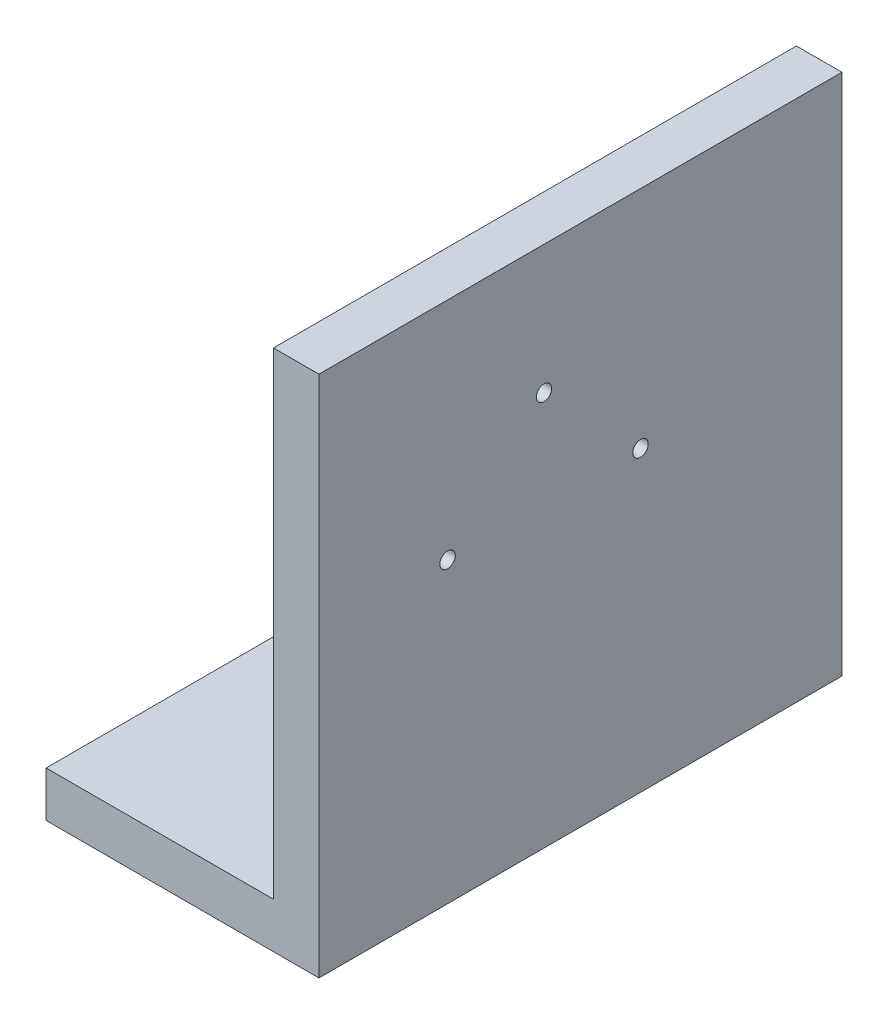
ISO-10303-21;
HEADER;
FILE_DESCRIPTION(('STEP AP214'),'2;1');
FILE_NAME('part.step','',(''),(''),'','','');
FILE_SCHEMA(('AUTOMOTIVE_DESIGN { 1 0 10303 214 1 1 1 1 }'));
ENDSEC;
DATA;
#1=APPLICATION_CONTEXT('core data for automotive mechanical design processes');
#2=APPLICATION_PROTOCOL_DEFINITION('international standard','automotive_design',2000,#1);
#3=PRODUCT_CONTEXT('',#1,'mechanical');
#4=PRODUCT('Part','Part','',(#3));
#5=PRODUCT_RELATED_PRODUCT_CATEGORY('part','',(#4));
#6=PRODUCT_DEFINITION_FORMATION('','',#4);
#7=PRODUCT_DEFINITION_CONTEXT('part definition',#1,'design');
#8=PRODUCT_DEFINITION('design','',#6,#7);
#9=PRODUCT_DEFINITION_SHAPE('','',#8);
#10=(LENGTH_UNIT() NAMED_UNIT(*) SI_UNIT(.MILLI.,.METRE.));
#11=(NAMED_UNIT(*) PLANE_ANGLE_UNIT() SI_UNIT($,.RADIAN.));
#12=(NAMED_UNIT(*) SI_UNIT($,.STERADIAN.) SOLID_ANGLE_UNIT());
#13=UNCERTAINTY_MEASURE_WITH_UNIT(LENGTH_MEASURE(1.E-05),#10,'distance_accuracy_value','');
#14=(GEOMETRIC_REPRESENTATION_CONTEXT(3) GLOBAL_UNCERTAINTY_ASSIGNED_CONTEXT((#13)) GLOBAL_UNIT_ASSIGNED_CONTEXT((#10,
#11,#12)) REPRESENTATION_CONTEXT('',''));
#15=CARTESIAN_POINT('',(0.,0.,0.));
#16=DIRECTION('',(0.,0.,1.));
#17=DIRECTION('',(1.,0.,0.));
#18=AXIS2_PLACEMENT_3D('',#15,#16,#17);
#19=CARTESIAN_POINT('',(-23565.4736245995,0.,0.));
#20=DIRECTION('',(1.,0.,0.));
#21=DIRECTION('',(0.,0.,-1.));
#22=AXIS2_PLACEMENT_3D('',#19,#20,#21);
#23=PLANE('',#22);
#24=CARTESIAN_POINT('',(-23565.4736245995,5877.69525550817,40145.5149033635));
#25=DIRECTION('',(-1.,0.,0.));
#26=DIRECTION('',(0.,0.,1.));
#27=AXIS2_PLACEMENT_3D('',#24,#25,#26);
#28=CIRCLE('',#27,3.39999999999935);
#29=CARTESIAN_POINT('',(-23565.4736245995,5877.69525550817,40148.9149033635));
#30=VERTEX_POINT('',#29);
#31=EDGE_CURVE('E139',#30,#30,#28,.T.);
#32=ORIENTED_EDGE('',*,*,#31,.F.);
#33=EDGE_LOOP('',(#32));
#34=FACE_BOUND('',#33,.T.);
#35=CARTESIAN_POINT('',(-23565.4736245995,5877.69525550817,40230.3677171059));
#36=DIRECTION('',(-1.,0.,0.));
#37=DIRECTION('',(0.,0.,1.));
#38=AXIS2_PLACEMENT_3D('',#35,#36,#37);
#39=CIRCLE('',#38,3.39999999999204);
#40=CARTESIAN_POINT('',(-23565.4736245995,5877.69525550817,40233.7677171059));
#41=VERTEX_POINT('',#40);
#42=EDGE_CURVE('E146',#41,#41,#39,.T.);
#43=ORIENTED_EDGE('',*,*,#42,.F.);
#44=EDGE_LOOP('',(#43));
#45=FACE_BOUND('',#44,.T.);
#46=CARTESIAN_POINT('',(-23565.4736245995,5920.12166237936,40187.9413102347));
#47=DIRECTION('',(-1.,0.,0.));
#48=DIRECTION('',(0.,0.,1.));
#49=AXIS2_PLACEMENT_3D('',#46,#47,#48);
#50=CIRCLE('',#49,3.39999999999935);
#51=CARTESIAN_POINT('',(-23565.4736245995,5920.12166237936,40191.3413102347));
#52=VERTEX_POINT('',#51);
#53=EDGE_CURVE('E111',#52,#52,#50,.T.);
#54=ORIENTED_EDGE('',*,*,#53,.F.);
#55=EDGE_LOOP('',(#54));
#56=FACE_BOUND('',#55,.T.);
#57=DIRECTION('',(0.,0.,-1.));
#58=VECTOR('',#57,1.);
#59=CARTESIAN_POINT('',(-23565.4736245995,5766.69020487429,40056.9362596009));
#60=LINE('',#59,#58);
#61=CARTESIAN_POINT('',(-23565.4736245995,5766.69020487429,40286.9362596009));
#62=VERTEX_POINT('',#61);
#63=CARTESIAN_POINT('',(-23565.4736245995,5766.69020487429,40056.9362596009));
#64=VERTEX_POINT('',#63);
#65=EDGE_CURVE('E54',#62,#64,#60,.T.);
#66=ORIENTED_EDGE('',*,*,#65,.F.);
#67=DIRECTION('',(0.,1.,0.));
#68=VECTOR('',#67,1.);
#69=CARTESIAN_POINT('',(-23565.4736245995,5976.69020487429,40286.9362596009));
#70=LINE('',#69,#68);
#71=CARTESIAN_POINT('',(-23565.4736245995,5976.69020487429,40286.9362596009));
#72=VERTEX_POINT('',#71);
#73=EDGE_CURVE('E92',#62,#72,#70,.T.);
#74=ORIENTED_EDGE('',*,*,#73,.T.);
#75=DIRECTION('',(0.,0.,-1.));
#76=VECTOR('',#75,1.);
#77=CARTESIAN_POINT('',(-23565.4736245995,5976.69020487429,40286.9362596009));
#78=LINE('',#77,#76);
#79=CARTESIAN_POINT('',(-23565.4736245995,5976.69020487429,40056.9362596009));
#80=VERTEX_POINT('',#79);
#81=EDGE_CURVE('E60',#72,#80,#78,.T.);
#82=ORIENTED_EDGE('',*,*,#81,.T.);
#83=DIRECTION('',(0.,-1.,0.));
#84=VECTOR('',#83,1.);
#85=CARTESIAN_POINT('',(-23565.4736245995,5976.69020487429,40056.9362596009));
#86=LINE('',#85,#84);
#87=EDGE_CURVE('E103',#80,#64,#86,.T.);
#88=ORIENTED_EDGE('',*,*,#87,.T.);
#89=EDGE_LOOP('',(#66,#74,#82,#88));
#90=FACE_BOUND('',#89,.T.);
#91=ADVANCED_FACE('F39',(#34,#45,#56,#90),#23,.F.);
#92=CARTESIAN_POINT('',(-23565.4736245995,5976.69020487429,40286.9362596009));
#93=DIRECTION('',(0.,0.,-1.));
#94=DIRECTION('',(-1.,0.,0.));
#95=AXIS2_PLACEMENT_3D('',#92,#93,#94);
#96=PLANE('',#95);
#97=DIRECTION('',(0.,1.,0.));
#98=VECTOR('',#97,1.);
#99=CARTESIAN_POINT('',(-23545.4736245995,5976.69020487429,40286.9362596009));
#100=LINE('',#99,#98);
#101=CARTESIAN_POINT('',(-23545.4736245995,5746.69020487429,40286.9362596009));
#102=VERTEX_POINT('',#101);
#103=CARTESIAN_POINT('',(-23545.4736245995,5976.69020487429,40286.9362596009));
#104=VERTEX_POINT('',#103);
#105=EDGE_CURVE('E99',#102,#104,#100,.T.);
#106=ORIENTED_EDGE('',*,*,#105,.T.);
#107=DIRECTION('',(1.,0.,0.));
#108=VECTOR('',#107,1.);
#109=CARTESIAN_POINT('',(-23565.4736245995,5976.69020487429,40286.9362596009));
#110=LINE('',#109,#108);
#111=EDGE_CURVE('E11',#72,#104,#110,.T.);
#112=ORIENTED_EDGE('',*,*,#111,.F.);
#113=ORIENTED_EDGE('',*,*,#73,.F.);
#114=DIRECTION('',(1.,0.,0.));
#115=VECTOR('',#114,1.);
#116=CARTESIAN_POINT('',(-23665.4736245995,5766.69020487429,40286.9362596009));
#117=LINE('',#116,#115);
#118=CARTESIAN_POINT('',(-23665.4736245995,5766.69020487429,40286.9362596009));
#119=VERTEX_POINT('',#118);
#120=EDGE_CURVE('E126',#119,#62,#117,.T.);
#121=ORIENTED_EDGE('',*,*,#120,.F.);
#122=DIRECTION('',(0.,1.,0.));
#123=VECTOR('',#122,1.);
#124=CARTESIAN_POINT('',(-23665.4736245995,5766.69020487429,40286.9362596009));
#125=LINE('',#124,#123);
#126=CARTESIAN_POINT('',(-23665.4736245995,5746.69020487429,40286.9362596009));
#127=VERTEX_POINT('',#126);
#128=EDGE_CURVE('E102',#127,#119,#125,.T.);
#129=ORIENTED_EDGE('',*,*,#128,.F.);
#130=DIRECTION('',(1.,0.,0.));
#131=VECTOR('',#130,1.);
#132=CARTESIAN_POINT('',(-23565.4736245995,5746.69020487429,40286.9362596009));
#133=LINE('',#132,#131);
#134=EDGE_CURVE('E85',#127,#102,#133,.T.);
#135=ORIENTED_EDGE('',*,*,#134,.T.);
#136=EDGE_LOOP('',(#106,#112,#113,#121,#129,#135));
#137=FACE_BOUND('',#136,.T.);
#138=ADVANCED_FACE('F41',(#137),#96,.F.);
#139=CARTESIAN_POINT('',(-23565.4736245995,5976.69020487429,40286.9362596009));
#140=DIRECTION('',(0.,-1.,0.));
#141=DIRECTION('',(1.,0.,0.));
#142=AXIS2_PLACEMENT_3D('',#139,#140,#141);
#143=PLANE('',#142);
#144=DIRECTION('',(0.,0.,-1.));
#145=VECTOR('',#144,1.);
#146=CARTESIAN_POINT('',(-23545.4736245995,5976.69020487429,40286.9362596009));
#147=LINE('',#146,#145);
#148=CARTESIAN_POINT('',(-23545.4736245995,5976.69020487429,40056.9362596009));
#149=VERTEX_POINT('',#148);
#150=EDGE_CURVE('E106',#104,#149,#147,.T.);
#151=ORIENTED_EDGE('',*,*,#150,.T.);
#152=DIRECTION('',(1.,0.,0.));
#153=VECTOR('',#152,1.);
#154=CARTESIAN_POINT('',(-23565.4736245995,5976.69020487429,40056.9362596009));
#155=LINE('',#154,#153);
#156=EDGE_CURVE('E47',#80,#149,#155,.T.);
#157=ORIENTED_EDGE('',*,*,#156,.F.);
#158=ORIENTED_EDGE('',*,*,#81,.F.);
#159=ORIENTED_EDGE('',*,*,#111,.T.);
#160=EDGE_LOOP('',(#151,#157,#158,#159));
#161=FACE_BOUND('',#160,.T.);
#162=ADVANCED_FACE('F123',(#161),#143,.F.);
#163=CARTESIAN_POINT('',(-23565.4736245995,5976.69020487429,40056.9362596009));
#164=DIRECTION('',(0.,0.,1.));
#165=DIRECTION('',(1.,0.,0.));
#166=AXIS2_PLACEMENT_3D('',#163,#164,#165);
#167=PLANE('',#166);
#168=DIRECTION('',(0.,-1.,0.));
#169=VECTOR('',#168,1.);
#170=CARTESIAN_POINT('',(-23545.4736245995,5976.69020487429,40056.9362596009));
#171=LINE('',#170,#169);
#172=CARTESIAN_POINT('',(-23545.4736245995,5746.69020487429,40056.9362596009));
#173=VERTEX_POINT('',#172);
#174=EDGE_CURVE('E93',#149,#173,#171,.T.);
#175=ORIENTED_EDGE('',*,*,#174,.T.);
#176=DIRECTION('',(1.,0.,0.));
#177=VECTOR('',#176,1.);
#178=CARTESIAN_POINT('',(-23565.4736245995,5746.69020487429,40056.9362596009));
#179=LINE('',#178,#177);
#180=CARTESIAN_POINT('',(-23665.4736245995,5746.69020487429,40056.9362596009));
#181=VERTEX_POINT('',#180);
#182=EDGE_CURVE('E88',#181,#173,#179,.T.);
#183=ORIENTED_EDGE('',*,*,#182,.F.);
#184=DIRECTION('',(0.,-1.,0.));
#185=VECTOR('',#184,1.);
#186=CARTESIAN_POINT('',(-23665.4736245995,5766.69020487429,40056.9362596009));
#187=LINE('',#186,#185);
#188=CARTESIAN_POINT('',(-23665.4736245995,5766.69020487429,40056.9362596009));
#189=VERTEX_POINT('',#188);
#190=EDGE_CURVE('E164',#189,#181,#187,.T.);
#191=ORIENTED_EDGE('',*,*,#190,.F.);
#192=DIRECTION('',(1.,0.,0.));
#193=VECTOR('',#192,1.);
#194=CARTESIAN_POINT('',(-23665.4736245995,5766.69020487429,40056.9362596009));
#195=LINE('',#194,#193);
#196=EDGE_CURVE('E136',#189,#64,#195,.T.);
#197=ORIENTED_EDGE('',*,*,#196,.T.);
#198=ORIENTED_EDGE('',*,*,#87,.F.);
#199=ORIENTED_EDGE('',*,*,#156,.T.);
#200=EDGE_LOOP('',(#175,#183,#191,#197,#198,#199));
#201=FACE_BOUND('',#200,.T.);
#202=ADVANCED_FACE('F120',(#201),#167,.F.);
#203=CARTESIAN_POINT('',(-23565.4736245995,5746.69020487429,40286.9362596009));
#204=DIRECTION('',(0.,1.,0.));
#205=DIRECTION('',(-1.,0.,0.));
#206=AXIS2_PLACEMENT_3D('',#203,#204,#205);
#207=PLANE('',#206);
#208=DIRECTION('',(0.,0.,1.));
#209=VECTOR('',#208,1.);
#210=CARTESIAN_POINT('',(-23545.4736245995,5746.69020487429,40286.9362596009));
#211=LINE('',#210,#209);
#212=EDGE_CURVE('E80',#173,#102,#211,.T.);
#213=ORIENTED_EDGE('',*,*,#212,.T.);
#214=ORIENTED_EDGE('',*,*,#134,.F.);
#215=DIRECTION('',(0.,0.,1.));
#216=VECTOR('',#215,1.);
#217=CARTESIAN_POINT('',(-23665.4736245995,5746.69020487429,40056.9362596009));
#218=LINE('',#217,#216);
#219=EDGE_CURVE('E161',#181,#127,#218,.T.);
#220=ORIENTED_EDGE('',*,*,#219,.F.);
#221=ORIENTED_EDGE('',*,*,#182,.T.);
#222=EDGE_LOOP('',(#213,#214,#220,#221));
#223=FACE_BOUND('',#222,.T.);
#224=ADVANCED_FACE('F82',(#223),#207,.F.);
#225=CARTESIAN_POINT('',(-23545.4736245995,0.,0.));
#226=DIRECTION('',(1.,0.,0.));
#227=DIRECTION('',(0.,0.,-1.));
#228=AXIS2_PLACEMENT_3D('',#225,#226,#227);
#229=PLANE('',#228);
#230=CARTESIAN_POINT('',(-23545.4736245995,5920.12166237936,40187.9413102347));
#231=DIRECTION('',(-1.,0.,0.));
#232=DIRECTION('',(0.,0.,1.));
#233=AXIS2_PLACEMENT_3D('',#230,#231,#232);
#234=CIRCLE('',#233,3.39999999999935);
#235=CARTESIAN_POINT('',(-23545.4736245995,5920.12166237936,40191.3413102347));
#236=VERTEX_POINT('',#235);
#237=EDGE_CURVE('E107',#236,#236,#234,.T.);
#238=ORIENTED_EDGE('',*,*,#237,.T.);
#239=EDGE_LOOP('',(#238));
#240=FACE_BOUND('',#239,.T.);
#241=CARTESIAN_POINT('',(-23545.4736245995,5877.69525550817,40230.3677171059));
#242=DIRECTION('',(-1.,0.,0.));
#243=DIRECTION('',(0.,0.,1.));
#244=AXIS2_PLACEMENT_3D('',#241,#242,#243);
#245=CIRCLE('',#244,3.39999999999204);
#246=CARTESIAN_POINT('',(-23545.4736245995,5877.69525550817,40233.7677171059));
#247=VERTEX_POINT('',#246);
#248=EDGE_CURVE('E149',#247,#247,#245,.T.);
#249=ORIENTED_EDGE('',*,*,#248,.T.);
#250=EDGE_LOOP('',(#249));
#251=FACE_BOUND('',#250,.T.);
#252=CARTESIAN_POINT('',(-23545.4736245995,5877.69525550817,40145.5149033635));
#253=DIRECTION('',(-1.,0.,0.));
#254=DIRECTION('',(0.,0.,1.));
#255=AXIS2_PLACEMENT_3D('',#252,#253,#254);
#256=CIRCLE('',#255,3.39999999999935);
#257=CARTESIAN_POINT('',(-23545.4736245995,5877.69525550817,40148.9149033635));
#258=VERTEX_POINT('',#257);
#259=EDGE_CURVE('E135',#258,#258,#256,.T.);
#260=ORIENTED_EDGE('',*,*,#259,.T.);
#261=EDGE_LOOP('',(#260));
#262=FACE_BOUND('',#261,.T.);
#263=ORIENTED_EDGE('',*,*,#105,.F.);
#264=ORIENTED_EDGE('',*,*,#212,.F.);
#265=ORIENTED_EDGE('',*,*,#174,.F.);
#266=ORIENTED_EDGE('',*,*,#150,.F.);
#267=EDGE_LOOP('',(#263,#264,#265,#266));
#268=FACE_BOUND('',#267,.T.);
#269=ADVANCED_FACE('F105',(#240,#251,#262,#268),#229,.T.);
#270=CARTESIAN_POINT('',(-23545.4736245995,5877.69525550817,40145.5149033635));
#271=DIRECTION('',(-1.,0.,0.));
#272=DIRECTION('',(0.,0.,1.));
#273=AXIS2_PLACEMENT_3D('',#270,#271,#272);
#274=CYLINDRICAL_SURFACE('',#273,3.39999999999935);
#275=ORIENTED_EDGE('',*,*,#259,.F.);
#276=EDGE_LOOP('',(#275));
#277=FACE_BOUND('',#276,.T.);
#278=ORIENTED_EDGE('',*,*,#31,.T.);
#279=EDGE_LOOP('',(#278));
#280=FACE_BOUND('',#279,.T.);
#281=ADVANCED_FACE('F185',(#277,#280),#274,.F.);
#282=CARTESIAN_POINT('',(-23545.4736245995,5877.69525550817,40230.3677171059));
#283=DIRECTION('',(-1.,0.,0.));
#284=DIRECTION('',(0.,0.,1.));
#285=AXIS2_PLACEMENT_3D('',#282,#283,#284);
#286=CYLINDRICAL_SURFACE('',#285,3.39999999999204);
#287=ORIENTED_EDGE('',*,*,#248,.F.);
#288=EDGE_LOOP('',(#287));
#289=FACE_BOUND('',#288,.T.);
#290=ORIENTED_EDGE('',*,*,#42,.T.);
#291=EDGE_LOOP('',(#290));
#292=FACE_BOUND('',#291,.T.);
#293=ADVANCED_FACE('F217',(#289,#292),#286,.F.);
#294=CARTESIAN_POINT('',(-23545.4736245995,5920.12166237936,40187.9413102347));
#295=DIRECTION('',(-1.,0.,0.));
#296=DIRECTION('',(0.,0.,1.));
#297=AXIS2_PLACEMENT_3D('',#294,#295,#296);
#298=CYLINDRICAL_SURFACE('',#297,3.39999999999935);
#299=ORIENTED_EDGE('',*,*,#237,.F.);
#300=EDGE_LOOP('',(#299));
#301=FACE_BOUND('',#300,.T.);
#302=ORIENTED_EDGE('',*,*,#53,.T.);
#303=EDGE_LOOP('',(#302));
#304=FACE_BOUND('',#303,.T.);
#305=ADVANCED_FACE('F173',(#301,#304),#298,.F.);
#306=CARTESIAN_POINT('',(-23665.4736245995,5766.69020487429,40056.9362596009));
#307=DIRECTION('',(0.,-1.,0.));
#308=DIRECTION('',(0.,0.,-1.));
#309=AXIS2_PLACEMENT_3D('',#306,#307,#308);
#310=PLANE('',#309);
#311=ORIENTED_EDGE('',*,*,#65,.T.);
#312=ORIENTED_EDGE('',*,*,#196,.F.);
#313=DIRECTION('',(0.,0.,-1.));
#314=VECTOR('',#313,1.);
#315=CARTESIAN_POINT('',(-23665.4736245995,5766.69020487429,40056.9362596009));
#316=LINE('',#315,#314);
#317=EDGE_CURVE('E134',#119,#189,#316,.T.);
#318=ORIENTED_EDGE('',*,*,#317,.F.);
#319=ORIENTED_EDGE('',*,*,#120,.T.);
#320=EDGE_LOOP('',(#311,#312,#318,#319));
#321=FACE_BOUND('',#320,.T.);
#322=ADVANCED_FACE('F130',(#321),#310,.F.);
#323=CARTESIAN_POINT('',(-23665.4736245995,0.,0.));
#324=DIRECTION('',(-1.,0.,0.));
#325=DIRECTION('',(0.,0.,1.));
#326=AXIS2_PLACEMENT_3D('',#323,#324,#325);
#327=PLANE('',#326);
#328=ORIENTED_EDGE('',*,*,#190,.T.);
#329=ORIENTED_EDGE('',*,*,#219,.T.);
#330=ORIENTED_EDGE('',*,*,#128,.T.);
#331=ORIENTED_EDGE('',*,*,#317,.T.);
#332=EDGE_LOOP('',(#328,#329,#330,#331));
#333=FACE_BOUND('',#332,.T.);
#334=ADVANCED_FACE('F160',(#333),#327,.T.);
#335=CLOSED_SHELL('',(#91,#138,#162,#202,#224,#269,#281,#293,#305,#322,#334));
#336=MANIFOLD_SOLID_BREP('B2',#335);
#337=ADVANCED_BREP_SHAPE_REPRESENTATION('',(#18,#336),#14);
#338=SHAPE_DEFINITION_REPRESENTATION(#9,#337);
ENDSEC;
END-ISO-10303-21;
